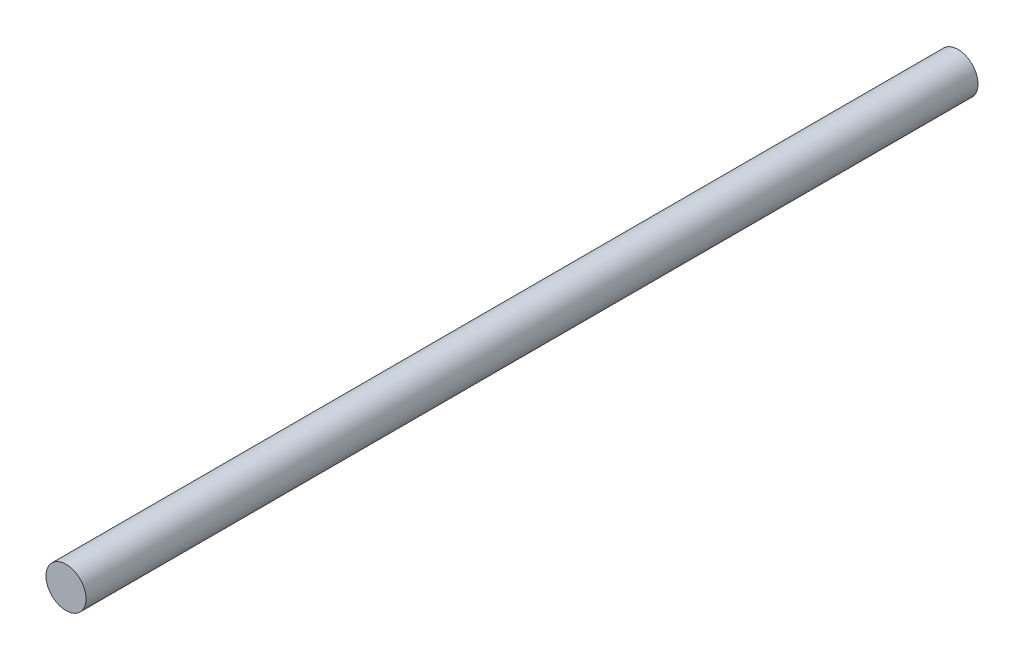
ISO-10303-21;
HEADER;
FILE_DESCRIPTION(('STEP AP214'),'2;1');
FILE_NAME('part.step','',(''),(''),'','','');
FILE_SCHEMA(('AUTOMOTIVE_DESIGN { 1 0 10303 214 1 1 1 1 }'));
ENDSEC;
DATA;
#1=APPLICATION_CONTEXT('core data for automotive mechanical design processes');
#2=APPLICATION_PROTOCOL_DEFINITION('international standard','automotive_design',2000,#1);
#3=PRODUCT_CONTEXT('',#1,'mechanical');
#4=PRODUCT('Part','Part','',(#3));
#5=PRODUCT_RELATED_PRODUCT_CATEGORY('part','',(#4));
#6=PRODUCT_DEFINITION_FORMATION('','',#4);
#7=PRODUCT_DEFINITION_CONTEXT('part definition',#1,'design');
#8=PRODUCT_DEFINITION('design','',#6,#7);
#9=PRODUCT_DEFINITION_SHAPE('','',#8);
#10=(LENGTH_UNIT() NAMED_UNIT(*) SI_UNIT(.MILLI.,.METRE.));
#11=(NAMED_UNIT(*) PLANE_ANGLE_UNIT() SI_UNIT($,.RADIAN.));
#12=(NAMED_UNIT(*) SI_UNIT($,.STERADIAN.) SOLID_ANGLE_UNIT());
#13=UNCERTAINTY_MEASURE_WITH_UNIT(LENGTH_MEASURE(1.E-05),#10,'distance_accuracy_value','');
#14=(GEOMETRIC_REPRESENTATION_CONTEXT(3) GLOBAL_UNCERTAINTY_ASSIGNED_CONTEXT((#13)) GLOBAL_UNIT_ASSIGNED_CONTEXT((#10,
#11,#12)) REPRESENTATION_CONTEXT('',''));
#15=CARTESIAN_POINT('',(0.,0.,0.));
#16=DIRECTION('',(0.,0.,1.));
#17=DIRECTION('',(1.,0.,0.));
#18=AXIS2_PLACEMENT_3D('',#15,#16,#17);
#19=CARTESIAN_POINT('',(0.,0.,88.9));
#20=DIRECTION('',(0.,0.,-1.));
#21=DIRECTION('',(-1.,0.,0.));
#22=AXIS2_PLACEMENT_3D('',#19,#20,#21);
#23=CYLINDRICAL_SURFACE('',#22,4.);
#24=CARTESIAN_POINT('',(0.,0.,88.9));
#25=DIRECTION('',(0.,0.,1.));
#26=DIRECTION('',(1.,0.,0.));
#27=AXIS2_PLACEMENT_3D('',#24,#25,#26);
#28=CIRCLE('',#27,4.);
#29=CARTESIAN_POINT('',(4.,0.,88.9));
#30=VERTEX_POINT('',#29);
#31=EDGE_CURVE('E10',#30,#30,#28,.T.);
#32=ORIENTED_EDGE('',*,*,#31,.F.);
#33=EDGE_LOOP('',(#32));
#34=FACE_BOUND('',#33,.T.);
#35=CARTESIAN_POINT('',(0.,0.,-88.9));
#36=DIRECTION('',(0.,0.,1.));
#37=DIRECTION('',(1.,0.,0.));
#38=AXIS2_PLACEMENT_3D('',#35,#36,#37);
#39=CIRCLE('',#38,4.);
#40=CARTESIAN_POINT('',(4.,0.,-88.9));
#41=VERTEX_POINT('',#40);
#42=EDGE_CURVE('E44',#41,#41,#39,.T.);
#43=ORIENTED_EDGE('',*,*,#42,.T.);
#44=EDGE_LOOP('',(#43));
#45=FACE_BOUND('',#44,.T.);
#46=ADVANCED_FACE('F41',(#34,#45),#23,.T.);
#47=CARTESIAN_POINT('',(0.,0.,88.9));
#48=DIRECTION('',(0.,0.,1.));
#49=DIRECTION('',(1.,0.,0.));
#50=AXIS2_PLACEMENT_3D('',#47,#48,#49);
#51=PLANE('',#50);
#52=ORIENTED_EDGE('',*,*,#31,.T.);
#53=EDGE_LOOP('',(#52));
#54=FACE_BOUND('',#53,.T.);
#55=ADVANCED_FACE('F58',(#54),#51,.T.);
#56=CARTESIAN_POINT('',(0.,0.,-88.9));
#57=DIRECTION('',(0.,0.,1.));
#58=DIRECTION('',(1.,0.,0.));
#59=AXIS2_PLACEMENT_3D('',#56,#57,#58);
#60=PLANE('',#59);
#61=ORIENTED_EDGE('',*,*,#42,.F.);
#62=EDGE_LOOP('',(#61));
#63=FACE_BOUND('',#62,.T.);
#64=ADVANCED_FACE('F56',(#63),#60,.F.);
#65=CLOSED_SHELL('',(#46,#55,#64));
#66=MANIFOLD_SOLID_BREP('B2',#65);
#67=ADVANCED_BREP_SHAPE_REPRESENTATION('',(#18,#66),#14);
#68=SHAPE_DEFINITION_REPRESENTATION(#9,#67);
ENDSEC;
END-ISO-10303-21;
